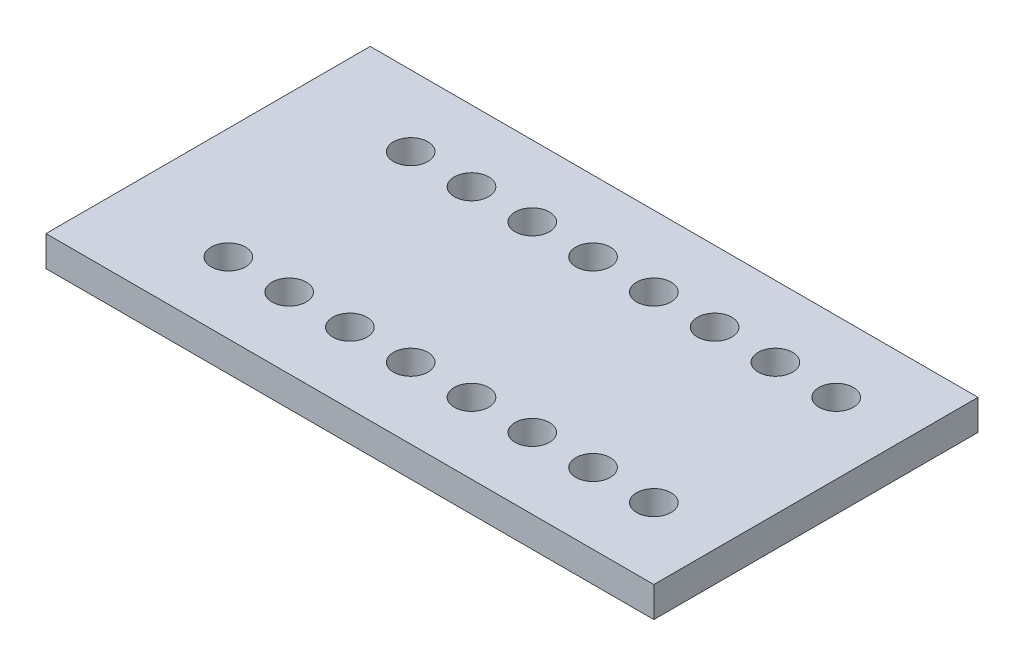
ISO-10303-21;
HEADER;
FILE_DESCRIPTION(('STEP AP214'),'2;1');
FILE_NAME('part.step','',(''),(''),'','','');
FILE_SCHEMA(('AUTOMOTIVE_DESIGN { 1 0 10303 214 1 1 1 1 }'));
ENDSEC;
DATA;
#1=APPLICATION_CONTEXT('core data for automotive mechanical design processes');
#2=APPLICATION_PROTOCOL_DEFINITION('international standard','automotive_design',2000,#1);
#3=PRODUCT_CONTEXT('',#1,'mechanical');
#4=PRODUCT('Part','Part','',(#3));
#5=PRODUCT_RELATED_PRODUCT_CATEGORY('part','',(#4));
#6=PRODUCT_DEFINITION_FORMATION('','',#4);
#7=PRODUCT_DEFINITION_CONTEXT('part definition',#1,'design');
#8=PRODUCT_DEFINITION('design','',#6,#7);
#9=PRODUCT_DEFINITION_SHAPE('','',#8);
#10=(LENGTH_UNIT() NAMED_UNIT(*) SI_UNIT(.MILLI.,.METRE.));
#11=(NAMED_UNIT(*) PLANE_ANGLE_UNIT() SI_UNIT($,.RADIAN.));
#12=(NAMED_UNIT(*) SI_UNIT($,.STERADIAN.) SOLID_ANGLE_UNIT());
#13=UNCERTAINTY_MEASURE_WITH_UNIT(LENGTH_MEASURE(1.E-05),#10,'distance_accuracy_value','');
#14=(GEOMETRIC_REPRESENTATION_CONTEXT(3) GLOBAL_UNCERTAINTY_ASSIGNED_CONTEXT((#13)) GLOBAL_UNIT_ASSIGNED_CONTEXT((#10,
#11,#12)) REPRESENTATION_CONTEXT('',''));
#15=CARTESIAN_POINT('',(0.,0.,0.));
#16=DIRECTION('',(0.,0.,1.));
#17=DIRECTION('',(1.,0.,0.));
#18=AXIS2_PLACEMENT_3D('',#15,#16,#17);
#19=CARTESIAN_POINT('',(84.9999999999999,30.0010000000005,-44.9999999999998));
#20=DIRECTION('',(0.,-1.,0.));
#21=DIRECTION('',(0.,0.,-1.));
#22=AXIS2_PLACEMENT_3D('',#19,#20,#21);
#23=CYLINDRICAL_SURFACE('',#22,8.50000000000001);
#24=CARTESIAN_POINT('',(84.9999999999999,-28.0000000000001,-45.0000000000001));
#25=DIRECTION('',(0.,-1.,0.));
#26=DIRECTION('',(0.,0.,-1.));
#27=AXIS2_PLACEMENT_3D('',#24,#25,#26);
#28=CIRCLE('',#27,8.50000000000001);
#29=CARTESIAN_POINT('',(84.9999999999999,-28.0000000000001,-53.5000000000001));
#30=VERTEX_POINT('',#29);
#31=EDGE_CURVE('E41',#30,#30,#28,.T.);
#32=ORIENTED_EDGE('',*,*,#31,.T.);
#33=EDGE_LOOP('',(#32));
#34=FACE_BOUND('',#33,.T.);
#35=CARTESIAN_POINT('',(84.9999999999999,-13.0000000000001,-45.));
#36=DIRECTION('',(0.,-1.,0.));
#37=DIRECTION('',(0.,0.,-1.));
#38=AXIS2_PLACEMENT_3D('',#35,#36,#37);
#39=CIRCLE('',#38,8.50000000000001);
#40=CARTESIAN_POINT('',(84.9999999999999,-13.0000000000001,-53.5));
#41=VERTEX_POINT('',#40);
#42=EDGE_CURVE('E11',#41,#41,#39,.F.);
#43=ORIENTED_EDGE('',*,*,#42,.T.);
#44=EDGE_LOOP('',(#43));
#45=FACE_BOUND('',#44,.T.);
#46=ADVANCED_FACE('F33',(#34,#45),#23,.F.);
#47=CARTESIAN_POINT('',(115.,30.0010000000005,-44.9999999999998));
#48=DIRECTION('',(0.,-1.,0.));
#49=DIRECTION('',(0.,0.,-1.));
#50=AXIS2_PLACEMENT_3D('',#47,#48,#49);
#51=CYLINDRICAL_SURFACE('',#50,8.50000000000001);
#52=CARTESIAN_POINT('',(115.,-28.0000000000001,-45.0000000000001));
#53=DIRECTION('',(0.,-1.,0.));
#54=DIRECTION('',(0.,0.,-1.));
#55=AXIS2_PLACEMENT_3D('',#52,#53,#54);
#56=CIRCLE('',#55,8.50000000000001);
#57=CARTESIAN_POINT('',(115.,-28.0000000000001,-53.5000000000001));
#58=VERTEX_POINT('',#57);
#59=EDGE_CURVE('E171',#58,#58,#56,.T.);
#60=ORIENTED_EDGE('',*,*,#59,.T.);
#61=EDGE_LOOP('',(#60));
#62=FACE_BOUND('',#61,.T.);
#63=CARTESIAN_POINT('',(115.,-13.0000000000001,-45.));
#64=DIRECTION('',(0.,-1.,0.));
#65=DIRECTION('',(0.,0.,-1.));
#66=AXIS2_PLACEMENT_3D('',#63,#64,#65);
#67=CIRCLE('',#66,8.50000000000001);
#68=CARTESIAN_POINT('',(115.,-13.0000000000001,-53.5));
#69=VERTEX_POINT('',#68);
#70=EDGE_CURVE('E174',#69,#69,#67,.F.);
#71=ORIENTED_EDGE('',*,*,#70,.T.);
#72=EDGE_LOOP('',(#71));
#73=FACE_BOUND('',#72,.T.);
#74=ADVANCED_FACE('F196',(#62,#73),#51,.F.);
#75=CARTESIAN_POINT('',(145.,30.0010000000005,-44.9999999999998));
#76=DIRECTION('',(0.,-1.,0.));
#77=DIRECTION('',(0.,0.,-1.));
#78=AXIS2_PLACEMENT_3D('',#75,#76,#77);
#79=CYLINDRICAL_SURFACE('',#78,8.50000000000001);
#80=CARTESIAN_POINT('',(145.,-28.0000000000001,-45.0000000000001));
#81=DIRECTION('',(0.,-1.,0.));
#82=DIRECTION('',(0.,0.,-1.));
#83=AXIS2_PLACEMENT_3D('',#80,#81,#82);
#84=CIRCLE('',#83,8.50000000000001);
#85=CARTESIAN_POINT('',(145.,-28.0000000000001,-53.5000000000001));
#86=VERTEX_POINT('',#85);
#87=EDGE_CURVE('E165',#86,#86,#84,.T.);
#88=ORIENTED_EDGE('',*,*,#87,.T.);
#89=EDGE_LOOP('',(#88));
#90=FACE_BOUND('',#89,.T.);
#91=CARTESIAN_POINT('',(145.,-13.0000000000001,-45.));
#92=DIRECTION('',(0.,-1.,0.));
#93=DIRECTION('',(0.,0.,-1.));
#94=AXIS2_PLACEMENT_3D('',#91,#92,#93);
#95=CIRCLE('',#94,8.50000000000001);
#96=CARTESIAN_POINT('',(145.,-13.0000000000001,-53.5));
#97=VERTEX_POINT('',#96);
#98=EDGE_CURVE('E168',#97,#97,#95,.F.);
#99=ORIENTED_EDGE('',*,*,#98,.T.);
#100=EDGE_LOOP('',(#99));
#101=FACE_BOUND('',#100,.T.);
#102=ADVANCED_FACE('F200',(#90,#101),#79,.F.);
#103=CARTESIAN_POINT('',(175.,30.0010000000005,-44.9999999999998));
#104=DIRECTION('',(0.,-1.,0.));
#105=DIRECTION('',(0.,0.,-1.));
#106=AXIS2_PLACEMENT_3D('',#103,#104,#105);
#107=CYLINDRICAL_SURFACE('',#106,8.50000000000001);
#108=CARTESIAN_POINT('',(175.,-28.0000000000001,-45.0000000000001));
#109=DIRECTION('',(0.,-1.,0.));
#110=DIRECTION('',(0.,0.,-1.));
#111=AXIS2_PLACEMENT_3D('',#108,#109,#110);
#112=CIRCLE('',#111,8.50000000000001);
#113=CARTESIAN_POINT('',(175.,-28.0000000000001,-53.5000000000001));
#114=VERTEX_POINT('',#113);
#115=EDGE_CURVE('E159',#114,#114,#112,.T.);
#116=ORIENTED_EDGE('',*,*,#115,.T.);
#117=EDGE_LOOP('',(#116));
#118=FACE_BOUND('',#117,.T.);
#119=CARTESIAN_POINT('',(175.,-13.0000000000001,-45.));
#120=DIRECTION('',(0.,-1.,0.));
#121=DIRECTION('',(0.,0.,-1.));
#122=AXIS2_PLACEMENT_3D('',#119,#120,#121);
#123=CIRCLE('',#122,8.50000000000001);
#124=CARTESIAN_POINT('',(175.,-13.0000000000001,-53.5));
#125=VERTEX_POINT('',#124);
#126=EDGE_CURVE('E162',#125,#125,#123,.F.);
#127=ORIENTED_EDGE('',*,*,#126,.T.);
#128=EDGE_LOOP('',(#127));
#129=FACE_BOUND('',#128,.T.);
#130=ADVANCED_FACE('F205',(#118,#129),#107,.F.);
#131=CARTESIAN_POINT('',(205.,30.0010000000005,-44.9999999999998));
#132=DIRECTION('',(0.,-1.,0.));
#133=DIRECTION('',(0.,0.,-1.));
#134=AXIS2_PLACEMENT_3D('',#131,#132,#133);
#135=CYLINDRICAL_SURFACE('',#134,8.50000000000001);
#136=CARTESIAN_POINT('',(205.,-28.0000000000001,-45.0000000000001));
#137=DIRECTION('',(0.,-1.,0.));
#138=DIRECTION('',(0.,0.,-1.));
#139=AXIS2_PLACEMENT_3D('',#136,#137,#138);
#140=CIRCLE('',#139,8.50000000000001);
#141=CARTESIAN_POINT('',(205.,-28.0000000000001,-53.5000000000001));
#142=VERTEX_POINT('',#141);
#143=EDGE_CURVE('E153',#142,#142,#140,.T.);
#144=ORIENTED_EDGE('',*,*,#143,.T.);
#145=EDGE_LOOP('',(#144));
#146=FACE_BOUND('',#145,.T.);
#147=CARTESIAN_POINT('',(205.,-13.0000000000001,-45.));
#148=DIRECTION('',(0.,-1.,0.));
#149=DIRECTION('',(0.,0.,-1.));
#150=AXIS2_PLACEMENT_3D('',#147,#148,#149);
#151=CIRCLE('',#150,8.50000000000001);
#152=CARTESIAN_POINT('',(205.,-13.0000000000001,-53.5));
#153=VERTEX_POINT('',#152);
#154=EDGE_CURVE('E156',#153,#153,#151,.F.);
#155=ORIENTED_EDGE('',*,*,#154,.T.);
#156=EDGE_LOOP('',(#155));
#157=FACE_BOUND('',#156,.T.);
#158=ADVANCED_FACE('F212',(#146,#157),#135,.F.);
#159=CARTESIAN_POINT('',(235.,30.0010000000005,-44.9999999999998));
#160=DIRECTION('',(0.,-1.,0.));
#161=DIRECTION('',(0.,0.,-1.));
#162=AXIS2_PLACEMENT_3D('',#159,#160,#161);
#163=CYLINDRICAL_SURFACE('',#162,8.50000000000001);
#164=CARTESIAN_POINT('',(235.,-28.0000000000001,-45.0000000000001));
#165=DIRECTION('',(0.,-1.,0.));
#166=DIRECTION('',(0.,0.,-1.));
#167=AXIS2_PLACEMENT_3D('',#164,#165,#166);
#168=CIRCLE('',#167,8.50000000000001);
#169=CARTESIAN_POINT('',(235.,-28.0000000000001,-53.5000000000001));
#170=VERTEX_POINT('',#169);
#171=EDGE_CURVE('E147',#170,#170,#168,.T.);
#172=ORIENTED_EDGE('',*,*,#171,.T.);
#173=EDGE_LOOP('',(#172));
#174=FACE_BOUND('',#173,.T.);
#175=CARTESIAN_POINT('',(235.,-13.0000000000001,-45.));
#176=DIRECTION('',(0.,-1.,0.));
#177=DIRECTION('',(0.,0.,-1.));
#178=AXIS2_PLACEMENT_3D('',#175,#176,#177);
#179=CIRCLE('',#178,8.50000000000001);
#180=CARTESIAN_POINT('',(235.,-13.0000000000001,-53.5));
#181=VERTEX_POINT('',#180);
#182=EDGE_CURVE('E150',#181,#181,#179,.F.);
#183=ORIENTED_EDGE('',*,*,#182,.T.);
#184=EDGE_LOOP('',(#183));
#185=FACE_BOUND('',#184,.T.);
#186=ADVANCED_FACE('F216',(#174,#185),#163,.F.);
#187=CARTESIAN_POINT('',(84.9999999999999,30.0010000000002,45.0000000000002));
#188=DIRECTION('',(0.,-1.,0.));
#189=DIRECTION('',(0.,0.,-1.));
#190=AXIS2_PLACEMENT_3D('',#187,#188,#189);
#191=CYLINDRICAL_SURFACE('',#190,8.50000000000001);
#192=CARTESIAN_POINT('',(84.9999999999999,-28.0000000000004,45.));
#193=DIRECTION('',(0.,-1.,0.));
#194=DIRECTION('',(0.,0.,-1.));
#195=AXIS2_PLACEMENT_3D('',#192,#193,#194);
#196=CIRCLE('',#195,8.50000000000001);
#197=CARTESIAN_POINT('',(84.9999999999999,-28.0000000000004,36.5));
#198=VERTEX_POINT('',#197);
#199=EDGE_CURVE('E141',#198,#198,#196,.T.);
#200=ORIENTED_EDGE('',*,*,#199,.T.);
#201=EDGE_LOOP('',(#200));
#202=FACE_BOUND('',#201,.T.);
#203=CARTESIAN_POINT('',(84.9999999999999,-13.0000000000004,45.));
#204=DIRECTION('',(0.,-1.,0.));
#205=DIRECTION('',(0.,0.,-1.));
#206=AXIS2_PLACEMENT_3D('',#203,#204,#205);
#207=CIRCLE('',#206,8.50000000000001);
#208=CARTESIAN_POINT('',(84.9999999999999,-13.0000000000004,36.5));
#209=VERTEX_POINT('',#208);
#210=EDGE_CURVE('E144',#209,#209,#207,.F.);
#211=ORIENTED_EDGE('',*,*,#210,.T.);
#212=EDGE_LOOP('',(#211));
#213=FACE_BOUND('',#212,.T.);
#214=ADVANCED_FACE('F220',(#202,#213),#191,.F.);
#215=CARTESIAN_POINT('',(115.,30.0010000000002,45.0000000000002));
#216=DIRECTION('',(0.,-1.,0.));
#217=DIRECTION('',(0.,0.,-1.));
#218=AXIS2_PLACEMENT_3D('',#215,#216,#217);
#219=CYLINDRICAL_SURFACE('',#218,8.50000000000001);
#220=CARTESIAN_POINT('',(115.,-28.0000000000004,45.));
#221=DIRECTION('',(0.,-1.,0.));
#222=DIRECTION('',(0.,0.,-1.));
#223=AXIS2_PLACEMENT_3D('',#220,#221,#222);
#224=CIRCLE('',#223,8.50000000000001);
#225=CARTESIAN_POINT('',(115.,-28.0000000000004,36.5));
#226=VERTEX_POINT('',#225);
#227=EDGE_CURVE('E135',#226,#226,#224,.T.);
#228=ORIENTED_EDGE('',*,*,#227,.T.);
#229=EDGE_LOOP('',(#228));
#230=FACE_BOUND('',#229,.T.);
#231=CARTESIAN_POINT('',(115.,-13.0000000000004,45.));
#232=DIRECTION('',(0.,-1.,0.));
#233=DIRECTION('',(0.,0.,-1.));
#234=AXIS2_PLACEMENT_3D('',#231,#232,#233);
#235=CIRCLE('',#234,8.50000000000001);
#236=CARTESIAN_POINT('',(115.,-13.0000000000004,36.5));
#237=VERTEX_POINT('',#236);
#238=EDGE_CURVE('E138',#237,#237,#235,.F.);
#239=ORIENTED_EDGE('',*,*,#238,.T.);
#240=EDGE_LOOP('',(#239));
#241=FACE_BOUND('',#240,.T.);
#242=ADVANCED_FACE('F224',(#230,#241),#219,.F.);
#243=CARTESIAN_POINT('',(145.,30.0010000000002,45.0000000000002));
#244=DIRECTION('',(0.,-1.,0.));
#245=DIRECTION('',(0.,0.,-1.));
#246=AXIS2_PLACEMENT_3D('',#243,#244,#245);
#247=CYLINDRICAL_SURFACE('',#246,8.50000000000001);
#248=CARTESIAN_POINT('',(145.,-28.0000000000004,45.));
#249=DIRECTION('',(0.,-1.,0.));
#250=DIRECTION('',(0.,0.,-1.));
#251=AXIS2_PLACEMENT_3D('',#248,#249,#250);
#252=CIRCLE('',#251,8.50000000000001);
#253=CARTESIAN_POINT('',(145.,-28.0000000000004,36.5));
#254=VERTEX_POINT('',#253);
#255=EDGE_CURVE('E129',#254,#254,#252,.T.);
#256=ORIENTED_EDGE('',*,*,#255,.T.);
#257=EDGE_LOOP('',(#256));
#258=FACE_BOUND('',#257,.T.);
#259=CARTESIAN_POINT('',(145.,-13.0000000000004,45.));
#260=DIRECTION('',(0.,-1.,0.));
#261=DIRECTION('',(0.,0.,-1.));
#262=AXIS2_PLACEMENT_3D('',#259,#260,#261);
#263=CIRCLE('',#262,8.50000000000001);
#264=CARTESIAN_POINT('',(145.,-13.0000000000004,36.5));
#265=VERTEX_POINT('',#264);
#266=EDGE_CURVE('E132',#265,#265,#263,.F.);
#267=ORIENTED_EDGE('',*,*,#266,.T.);
#268=EDGE_LOOP('',(#267));
#269=FACE_BOUND('',#268,.T.);
#270=ADVANCED_FACE('F228',(#258,#269),#247,.F.);
#271=CARTESIAN_POINT('',(175.,30.0010000000002,45.0000000000002));
#272=DIRECTION('',(0.,-1.,0.));
#273=DIRECTION('',(0.,0.,-1.));
#274=AXIS2_PLACEMENT_3D('',#271,#272,#273);
#275=CYLINDRICAL_SURFACE('',#274,8.50000000000001);
#276=CARTESIAN_POINT('',(175.,-28.0000000000004,45.));
#277=DIRECTION('',(0.,-1.,0.));
#278=DIRECTION('',(0.,0.,-1.));
#279=AXIS2_PLACEMENT_3D('',#276,#277,#278);
#280=CIRCLE('',#279,8.50000000000001);
#281=CARTESIAN_POINT('',(175.,-28.0000000000004,36.5));
#282=VERTEX_POINT('',#281);
#283=EDGE_CURVE('E123',#282,#282,#280,.T.);
#284=ORIENTED_EDGE('',*,*,#283,.T.);
#285=EDGE_LOOP('',(#284));
#286=FACE_BOUND('',#285,.T.);
#287=CARTESIAN_POINT('',(175.,-13.0000000000004,45.));
#288=DIRECTION('',(0.,-1.,0.));
#289=DIRECTION('',(0.,0.,-1.));
#290=AXIS2_PLACEMENT_3D('',#287,#288,#289);
#291=CIRCLE('',#290,8.50000000000001);
#292=CARTESIAN_POINT('',(175.,-13.0000000000004,36.5));
#293=VERTEX_POINT('',#292);
#294=EDGE_CURVE('E126',#293,#293,#291,.F.);
#295=ORIENTED_EDGE('',*,*,#294,.T.);
#296=EDGE_LOOP('',(#295));
#297=FACE_BOUND('',#296,.T.);
#298=ADVANCED_FACE('F232',(#286,#297),#275,.F.);
#299=CARTESIAN_POINT('',(205.,30.0010000000002,45.0000000000002));
#300=DIRECTION('',(0.,-1.,0.));
#301=DIRECTION('',(0.,0.,-1.));
#302=AXIS2_PLACEMENT_3D('',#299,#300,#301);
#303=CYLINDRICAL_SURFACE('',#302,8.50000000000001);
#304=CARTESIAN_POINT('',(205.,-28.0000000000004,45.));
#305=DIRECTION('',(0.,-1.,0.));
#306=DIRECTION('',(0.,0.,-1.));
#307=AXIS2_PLACEMENT_3D('',#304,#305,#306);
#308=CIRCLE('',#307,8.50000000000001);
#309=CARTESIAN_POINT('',(205.,-28.0000000000004,36.5));
#310=VERTEX_POINT('',#309);
#311=EDGE_CURVE('E117',#310,#310,#308,.T.);
#312=ORIENTED_EDGE('',*,*,#311,.T.);
#313=EDGE_LOOP('',(#312));
#314=FACE_BOUND('',#313,.T.);
#315=CARTESIAN_POINT('',(205.,-13.0000000000004,45.));
#316=DIRECTION('',(0.,-1.,0.));
#317=DIRECTION('',(0.,0.,-1.));
#318=AXIS2_PLACEMENT_3D('',#315,#316,#317);
#319=CIRCLE('',#318,8.50000000000001);
#320=CARTESIAN_POINT('',(205.,-13.0000000000004,36.5));
#321=VERTEX_POINT('',#320);
#322=EDGE_CURVE('E120',#321,#321,#319,.F.);
#323=ORIENTED_EDGE('',*,*,#322,.T.);
#324=EDGE_LOOP('',(#323));
#325=FACE_BOUND('',#324,.T.);
#326=ADVANCED_FACE('F236',(#314,#325),#303,.F.);
#327=CARTESIAN_POINT('',(235.,30.0010000000002,45.0000000000002));
#328=DIRECTION('',(0.,-1.,0.));
#329=DIRECTION('',(0.,0.,-1.));
#330=AXIS2_PLACEMENT_3D('',#327,#328,#329);
#331=CYLINDRICAL_SURFACE('',#330,8.50000000000001);
#332=CARTESIAN_POINT('',(235.,-28.0000000000004,45.));
#333=DIRECTION('',(0.,-1.,0.));
#334=DIRECTION('',(0.,0.,-1.));
#335=AXIS2_PLACEMENT_3D('',#332,#333,#334);
#336=CIRCLE('',#335,8.50000000000001);
#337=CARTESIAN_POINT('',(235.,-28.0000000000004,36.5));
#338=VERTEX_POINT('',#337);
#339=EDGE_CURVE('E111',#338,#338,#336,.T.);
#340=ORIENTED_EDGE('',*,*,#339,.T.);
#341=EDGE_LOOP('',(#340));
#342=FACE_BOUND('',#341,.T.);
#343=CARTESIAN_POINT('',(235.,-13.0000000000004,45.));
#344=DIRECTION('',(0.,-1.,0.));
#345=DIRECTION('',(0.,0.,-1.));
#346=AXIS2_PLACEMENT_3D('',#343,#344,#345);
#347=CIRCLE('',#346,8.50000000000001);
#348=CARTESIAN_POINT('',(235.,-13.0000000000004,36.5));
#349=VERTEX_POINT('',#348);
#350=EDGE_CURVE('E114',#349,#349,#347,.F.);
#351=ORIENTED_EDGE('',*,*,#350,.T.);
#352=EDGE_LOOP('',(#351));
#353=FACE_BOUND('',#352,.T.);
#354=ADVANCED_FACE('F240',(#342,#353),#331,.F.);
#355=CARTESIAN_POINT('',(330.,-13.,-80.));
#356=DIRECTION('',(0.,0.,1.));
#357=DIRECTION('',(0.,-1.,0.));
#358=AXIS2_PLACEMENT_3D('',#355,#356,#357);
#359=PLANE('',#358);
#360=DIRECTION('',(0.,1.,0.));
#361=VECTOR('',#360,1.);
#362=CARTESIAN_POINT('',(30.,-13.,-80.));
#363=LINE('',#362,#361);
#364=CARTESIAN_POINT('',(30.,-28.,-80.0000000000001));
#365=VERTEX_POINT('',#364);
#366=CARTESIAN_POINT('',(30.,-13.,-80.));
#367=VERTEX_POINT('',#366);
#368=EDGE_CURVE('E101',#365,#367,#363,.T.);
#369=ORIENTED_EDGE('',*,*,#368,.T.);
#370=DIRECTION('',(-1.,0.,0.));
#371=VECTOR('',#370,1.);
#372=CARTESIAN_POINT('',(330.,-13.,-80.));
#373=LINE('',#372,#371);
#374=CARTESIAN_POINT('',(330.,-13.,-80.));
#375=VERTEX_POINT('',#374);
#376=EDGE_CURVE('E92',#375,#367,#373,.T.);
#377=ORIENTED_EDGE('',*,*,#376,.F.);
#378=DIRECTION('',(0.,1.,0.));
#379=VECTOR('',#378,1.);
#380=CARTESIAN_POINT('',(330.,-13.,-80.));
#381=LINE('',#380,#379);
#382=CARTESIAN_POINT('',(330.,-28.,-80.0000000000001));
#383=VERTEX_POINT('',#382);
#384=EDGE_CURVE('E85',#383,#375,#381,.T.);
#385=ORIENTED_EDGE('',*,*,#384,.F.);
#386=DIRECTION('',(-1.,0.,0.));
#387=VECTOR('',#386,1.);
#388=CARTESIAN_POINT('',(330.,-28.,-80.0000000000001));
#389=LINE('',#388,#387);
#390=EDGE_CURVE('E97',#383,#365,#389,.T.);
#391=ORIENTED_EDGE('',*,*,#390,.T.);
#392=EDGE_LOOP('',(#369,#377,#385,#391));
#393=FACE_BOUND('',#392,.T.);
#394=ADVANCED_FACE('F244',(#393),#359,.F.);
#395=CARTESIAN_POINT('',(330.,-13.,-80.));
#396=DIRECTION('',(0.,-1.,0.));
#397=DIRECTION('',(0.,0.,-1.));
#398=AXIS2_PLACEMENT_3D('',#395,#396,#397);
#399=PLANE('',#398);
#400=CARTESIAN_POINT('',(265.,-13.0000000000001,-45.));
#401=DIRECTION('',(0.,-1.,0.));
#402=DIRECTION('',(0.,0.,-1.));
#403=AXIS2_PLACEMENT_3D('',#400,#401,#402);
#404=CIRCLE('',#403,8.50000000000001);
#405=CARTESIAN_POINT('',(265.,-13.0000000000001,-53.5));
#406=VERTEX_POINT('',#405);
#407=EDGE_CURVE('E256',#406,#406,#404,.F.);
#408=ORIENTED_EDGE('',*,*,#407,.F.);
#409=EDGE_LOOP('',(#408));
#410=FACE_BOUND('',#409,.T.);
#411=CARTESIAN_POINT('',(265.,-13.0000000000004,45.));
#412=DIRECTION('',(0.,-1.,0.));
#413=DIRECTION('',(0.,0.,-1.));
#414=AXIS2_PLACEMENT_3D('',#411,#412,#413);
#415=CIRCLE('',#414,8.50000000000001);
#416=CARTESIAN_POINT('',(265.,-13.0000000000004,36.5));
#417=VERTEX_POINT('',#416);
#418=EDGE_CURVE('E260',#417,#417,#415,.F.);
#419=ORIENTED_EDGE('',*,*,#418,.F.);
#420=EDGE_LOOP('',(#419));
#421=FACE_BOUND('',#420,.T.);
#422=CARTESIAN_POINT('',(295.,-13.0000000000004,45.));
#423=DIRECTION('',(0.,-1.,0.));
#424=DIRECTION('',(0.,0.,-1.));
#425=AXIS2_PLACEMENT_3D('',#422,#423,#424);
#426=CIRCLE('',#425,8.50000000000001);
#427=CARTESIAN_POINT('',(295.,-13.0000000000004,36.5));
#428=VERTEX_POINT('',#427);
#429=EDGE_CURVE('E104',#428,#428,#426,.F.);
#430=ORIENTED_EDGE('',*,*,#429,.F.);
#431=EDGE_LOOP('',(#430));
#432=FACE_BOUND('',#431,.T.);
#433=CARTESIAN_POINT('',(295.,-13.0000000000001,-45.));
#434=DIRECTION('',(0.,-1.,0.));
#435=DIRECTION('',(0.,0.,-1.));
#436=AXIS2_PLACEMENT_3D('',#433,#434,#435);
#437=CIRCLE('',#436,8.50000000000001);
#438=CARTESIAN_POINT('',(295.,-13.0000000000001,-53.5));
#439=VERTEX_POINT('',#438);
#440=EDGE_CURVE('E266',#439,#439,#437,.F.);
#441=ORIENTED_EDGE('',*,*,#440,.F.);
#442=EDGE_LOOP('',(#441));
#443=FACE_BOUND('',#442,.T.);
#444=DIRECTION('',(0.,0.,1.));
#445=VECTOR('',#444,1.);
#446=CARTESIAN_POINT('',(30.,-13.,-80.));
#447=LINE('',#446,#445);
#448=CARTESIAN_POINT('',(30.,-13.0000000000006,80.));
#449=VERTEX_POINT('',#448);
#450=EDGE_CURVE('E91',#367,#449,#447,.T.);
#451=ORIENTED_EDGE('',*,*,#450,.T.);
#452=DIRECTION('',(-1.,0.,0.));
#453=VECTOR('',#452,1.);
#454=CARTESIAN_POINT('',(330.,-13.0000000000006,80.));
#455=LINE('',#454,#453);
#456=CARTESIAN_POINT('',(330.,-13.0000000000006,80.));
#457=VERTEX_POINT('',#456);
#458=EDGE_CURVE('E88',#457,#449,#455,.T.);
#459=ORIENTED_EDGE('',*,*,#458,.F.);
#460=DIRECTION('',(0.,0.,1.));
#461=VECTOR('',#460,1.);
#462=CARTESIAN_POINT('',(330.,-13.,-80.));
#463=LINE('',#462,#461);
#464=EDGE_CURVE('E80',#375,#457,#463,.T.);
#465=ORIENTED_EDGE('',*,*,#464,.F.);
#466=ORIENTED_EDGE('',*,*,#376,.T.);
#467=EDGE_LOOP('',(#451,#459,#465,#466));
#468=FACE_BOUND('',#467,.T.);
#469=ORIENTED_EDGE('',*,*,#350,.F.);
#470=EDGE_LOOP('',(#469));
#471=FACE_BOUND('',#470,.T.);
#472=ORIENTED_EDGE('',*,*,#322,.F.);
#473=EDGE_LOOP('',(#472));
#474=FACE_BOUND('',#473,.T.);
#475=ORIENTED_EDGE('',*,*,#294,.F.);
#476=EDGE_LOOP('',(#475));
#477=FACE_BOUND('',#476,.T.);
#478=ORIENTED_EDGE('',*,*,#266,.F.);
#479=EDGE_LOOP('',(#478));
#480=FACE_BOUND('',#479,.T.);
#481=ORIENTED_EDGE('',*,*,#238,.F.);
#482=EDGE_LOOP('',(#481));
#483=FACE_BOUND('',#482,.T.);
#484=ORIENTED_EDGE('',*,*,#210,.F.);
#485=EDGE_LOOP('',(#484));
#486=FACE_BOUND('',#485,.T.);
#487=ORIENTED_EDGE('',*,*,#182,.F.);
#488=EDGE_LOOP('',(#487));
#489=FACE_BOUND('',#488,.T.);
#490=ORIENTED_EDGE('',*,*,#154,.F.);
#491=EDGE_LOOP('',(#490));
#492=FACE_BOUND('',#491,.T.);
#493=ORIENTED_EDGE('',*,*,#126,.F.);
#494=EDGE_LOOP('',(#493));
#495=FACE_BOUND('',#494,.T.);
#496=ORIENTED_EDGE('',*,*,#98,.F.);
#497=EDGE_LOOP('',(#496));
#498=FACE_BOUND('',#497,.T.);
#499=ORIENTED_EDGE('',*,*,#70,.F.);
#500=EDGE_LOOP('',(#499));
#501=FACE_BOUND('',#500,.T.);
#502=ORIENTED_EDGE('',*,*,#42,.F.);
#503=EDGE_LOOP('',(#502));
#504=FACE_BOUND('',#503,.T.);
#505=ADVANCED_FACE('F89',(#410,#421,#432,#443,#468,#471,#474,#477,#480,#483,#486,#489,#492,#495,
#498,#501,#504),#399,.F.);
#506=CARTESIAN_POINT('',(330.,-28.0000000000006,80.));
#507=DIRECTION('',(0.,0.,-1.));
#508=DIRECTION('',(0.,1.,0.));
#509=AXIS2_PLACEMENT_3D('',#506,#507,#508);
#510=PLANE('',#509);
#511=DIRECTION('',(0.,-1.,0.));
#512=VECTOR('',#511,1.);
#513=CARTESIAN_POINT('',(30.,-28.0000000000006,80.));
#514=LINE('',#513,#512);
#515=CARTESIAN_POINT('',(30.,-28.0000000000006,80.));
#516=VERTEX_POINT('',#515);
#517=EDGE_CURVE('E66',#449,#516,#514,.T.);
#518=ORIENTED_EDGE('',*,*,#517,.T.);
#519=DIRECTION('',(-1.,0.,0.));
#520=VECTOR('',#519,1.);
#521=CARTESIAN_POINT('',(330.,-28.0000000000006,80.));
#522=LINE('',#521,#520);
#523=CARTESIAN_POINT('',(330.,-28.0000000000006,80.));
#524=VERTEX_POINT('',#523);
#525=EDGE_CURVE('E93',#524,#516,#522,.T.);
#526=ORIENTED_EDGE('',*,*,#525,.F.);
#527=DIRECTION('',(0.,-1.,0.));
#528=VECTOR('',#527,1.);
#529=CARTESIAN_POINT('',(330.,-28.0000000000006,80.));
#530=LINE('',#529,#528);
#531=EDGE_CURVE('E83',#457,#524,#530,.T.);
#532=ORIENTED_EDGE('',*,*,#531,.F.);
#533=ORIENTED_EDGE('',*,*,#458,.T.);
#534=EDGE_LOOP('',(#518,#526,#532,#533));
#535=FACE_BOUND('',#534,.T.);
#536=ADVANCED_FACE('F95',(#535),#510,.F.);
#537=CARTESIAN_POINT('',(330.,-28.,-80.0000000000001));
#538=DIRECTION('',(0.,1.,0.));
#539=DIRECTION('',(0.,0.,1.));
#540=AXIS2_PLACEMENT_3D('',#537,#538,#539);
#541=PLANE('',#540);
#542=CARTESIAN_POINT('',(265.,-28.0000000000001,-45.0000000000001));
#543=DIRECTION('',(0.,-1.,0.));
#544=DIRECTION('',(0.,0.,-1.));
#545=AXIS2_PLACEMENT_3D('',#542,#543,#544);
#546=CIRCLE('',#545,8.50000000000001);
#547=CARTESIAN_POINT('',(265.,-28.0000000000001,-53.5000000000001));
#548=VERTEX_POINT('',#547);
#549=EDGE_CURVE('E282',#548,#548,#546,.T.);
#550=ORIENTED_EDGE('',*,*,#549,.F.);
#551=EDGE_LOOP('',(#550));
#552=FACE_BOUND('',#551,.T.);
#553=CARTESIAN_POINT('',(265.,-28.0000000000004,45.));
#554=DIRECTION('',(0.,-1.,0.));
#555=DIRECTION('',(0.,0.,-1.));
#556=AXIS2_PLACEMENT_3D('',#553,#554,#555);
#557=CIRCLE('',#556,8.50000000000001);
#558=CARTESIAN_POINT('',(265.,-28.0000000000004,36.5));
#559=VERTEX_POINT('',#558);
#560=EDGE_CURVE('E278',#559,#559,#557,.T.);
#561=ORIENTED_EDGE('',*,*,#560,.F.);
#562=EDGE_LOOP('',(#561));
#563=FACE_BOUND('',#562,.T.);
#564=CARTESIAN_POINT('',(295.,-28.0000000000004,45.));
#565=DIRECTION('',(0.,-1.,0.));
#566=DIRECTION('',(0.,0.,-1.));
#567=AXIS2_PLACEMENT_3D('',#564,#565,#566);
#568=CIRCLE('',#567,8.50000000000001);
#569=CARTESIAN_POINT('',(295.,-28.0000000000004,36.5));
#570=VERTEX_POINT('',#569);
#571=EDGE_CURVE('E268',#570,#570,#568,.T.);
#572=ORIENTED_EDGE('',*,*,#571,.F.);
#573=EDGE_LOOP('',(#572));
#574=FACE_BOUND('',#573,.T.);
#575=CARTESIAN_POINT('',(295.,-28.0000000000001,-45.0000000000001));
#576=DIRECTION('',(0.,-1.,0.));
#577=DIRECTION('',(0.,0.,-1.));
#578=AXIS2_PLACEMENT_3D('',#575,#576,#577);
#579=CIRCLE('',#578,8.50000000000001);
#580=CARTESIAN_POINT('',(295.,-28.0000000000001,-53.5000000000001));
#581=VERTEX_POINT('',#580);
#582=EDGE_CURVE('E269',#581,#581,#579,.T.);
#583=ORIENTED_EDGE('',*,*,#582,.F.);
#584=EDGE_LOOP('',(#583));
#585=FACE_BOUND('',#584,.T.);
#586=DIRECTION('',(0.,0.,-1.));
#587=VECTOR('',#586,1.);
#588=CARTESIAN_POINT('',(30.,-28.,-80.0000000000001));
#589=LINE('',#588,#587);
#590=EDGE_CURVE('E72',#516,#365,#589,.T.);
#591=ORIENTED_EDGE('',*,*,#590,.T.);
#592=ORIENTED_EDGE('',*,*,#390,.F.);
#593=DIRECTION('',(0.,0.,-1.));
#594=VECTOR('',#593,1.);
#595=CARTESIAN_POINT('',(330.,-28.,-80.0000000000001));
#596=LINE('',#595,#594);
#597=EDGE_CURVE('E49',#524,#383,#596,.T.);
#598=ORIENTED_EDGE('',*,*,#597,.F.);
#599=ORIENTED_EDGE('',*,*,#525,.T.);
#600=EDGE_LOOP('',(#591,#592,#598,#599));
#601=FACE_BOUND('',#600,.T.);
#602=ORIENTED_EDGE('',*,*,#339,.F.);
#603=EDGE_LOOP('',(#602));
#604=FACE_BOUND('',#603,.T.);
#605=ORIENTED_EDGE('',*,*,#311,.F.);
#606=EDGE_LOOP('',(#605));
#607=FACE_BOUND('',#606,.T.);
#608=ORIENTED_EDGE('',*,*,#283,.F.);
#609=EDGE_LOOP('',(#608));
#610=FACE_BOUND('',#609,.T.);
#611=ORIENTED_EDGE('',*,*,#255,.F.);
#612=EDGE_LOOP('',(#611));
#613=FACE_BOUND('',#612,.T.);
#614=ORIENTED_EDGE('',*,*,#227,.F.);
#615=EDGE_LOOP('',(#614));
#616=FACE_BOUND('',#615,.T.);
#617=ORIENTED_EDGE('',*,*,#199,.F.);
#618=EDGE_LOOP('',(#617));
#619=FACE_BOUND('',#618,.T.);
#620=ORIENTED_EDGE('',*,*,#171,.F.);
#621=EDGE_LOOP('',(#620));
#622=FACE_BOUND('',#621,.T.);
#623=ORIENTED_EDGE('',*,*,#143,.F.);
#624=EDGE_LOOP('',(#623));
#625=FACE_BOUND('',#624,.T.);
#626=ORIENTED_EDGE('',*,*,#115,.F.);
#627=EDGE_LOOP('',(#626));
#628=FACE_BOUND('',#627,.T.);
#629=ORIENTED_EDGE('',*,*,#87,.F.);
#630=EDGE_LOOP('',(#629));
#631=FACE_BOUND('',#630,.T.);
#632=ORIENTED_EDGE('',*,*,#59,.F.);
#633=EDGE_LOOP('',(#632));
#634=FACE_BOUND('',#633,.T.);
#635=ORIENTED_EDGE('',*,*,#31,.F.);
#636=EDGE_LOOP('',(#635));
#637=FACE_BOUND('',#636,.T.);
#638=ADVANCED_FACE('F181',(#552,#563,#574,#585,#601,#604,#607,#610,#613,#616,#619,#622,#625,
#628,#631,#634,#637),#541,.F.);
#639=CARTESIAN_POINT('',(330.,-7.50000000000028,80.));
#640=DIRECTION('',(-1.,0.,0.));
#641=DIRECTION('',(0.,0.,1.));
#642=AXIS2_PLACEMENT_3D('',#639,#640,#641);
#643=PLANE('',#642);
#644=ORIENTED_EDGE('',*,*,#384,.T.);
#645=ORIENTED_EDGE('',*,*,#464,.T.);
#646=ORIENTED_EDGE('',*,*,#531,.T.);
#647=ORIENTED_EDGE('',*,*,#597,.T.);
#648=EDGE_LOOP('',(#644,#645,#646,#647));
#649=FACE_BOUND('',#648,.T.);
#650=ADVANCED_FACE('F81',(#649),#643,.F.);
#651=CARTESIAN_POINT('',(30.,-7.50000000000028,80.));
#652=DIRECTION('',(-1.,0.,0.));
#653=DIRECTION('',(0.,0.,1.));
#654=AXIS2_PLACEMENT_3D('',#651,#652,#653);
#655=PLANE('',#654);
#656=ORIENTED_EDGE('',*,*,#368,.F.);
#657=ORIENTED_EDGE('',*,*,#590,.F.);
#658=ORIENTED_EDGE('',*,*,#517,.F.);
#659=ORIENTED_EDGE('',*,*,#450,.F.);
#660=EDGE_LOOP('',(#656,#657,#658,#659));
#661=FACE_BOUND('',#660,.T.);
#662=ADVANCED_FACE('F189',(#661),#655,.T.);
#663=CARTESIAN_POINT('',(295.,30.0010000000005,-44.9999999999998));
#664=DIRECTION('',(0.,-1.,0.));
#665=DIRECTION('',(0.,0.,-1.));
#666=AXIS2_PLACEMENT_3D('',#663,#664,#665);
#667=CYLINDRICAL_SURFACE('',#666,8.50000000000001);
#668=ORIENTED_EDGE('',*,*,#582,.T.);
#669=EDGE_LOOP('',(#668));
#670=FACE_BOUND('',#669,.T.);
#671=ORIENTED_EDGE('',*,*,#440,.T.);
#672=EDGE_LOOP('',(#671));
#673=FACE_BOUND('',#672,.T.);
#674=ADVANCED_FACE('F299',(#670,#673),#667,.F.);
#675=CARTESIAN_POINT('',(295.,30.0010000000002,45.0000000000002));
#676=DIRECTION('',(0.,-1.,0.));
#677=DIRECTION('',(0.,0.,-1.));
#678=AXIS2_PLACEMENT_3D('',#675,#676,#677);
#679=CYLINDRICAL_SURFACE('',#678,8.50000000000001);
#680=ORIENTED_EDGE('',*,*,#571,.T.);
#681=EDGE_LOOP('',(#680));
#682=FACE_BOUND('',#681,.T.);
#683=ORIENTED_EDGE('',*,*,#429,.T.);
#684=EDGE_LOOP('',(#683));
#685=FACE_BOUND('',#684,.T.);
#686=ADVANCED_FACE('F293',(#682,#685),#679,.F.);
#687=CARTESIAN_POINT('',(265.,30.0010000000002,45.0000000000002));
#688=DIRECTION('',(0.,-1.,0.));
#689=DIRECTION('',(0.,0.,-1.));
#690=AXIS2_PLACEMENT_3D('',#687,#688,#689);
#691=CYLINDRICAL_SURFACE('',#690,8.50000000000001);
#692=ORIENTED_EDGE('',*,*,#560,.T.);
#693=EDGE_LOOP('',(#692));
#694=FACE_BOUND('',#693,.T.);
#695=ORIENTED_EDGE('',*,*,#418,.T.);
#696=EDGE_LOOP('',(#695));
#697=FACE_BOUND('',#696,.T.);
#698=ADVANCED_FACE('F288',(#694,#697),#691,.F.);
#699=CARTESIAN_POINT('',(265.,30.0010000000005,-44.9999999999998));
#700=DIRECTION('',(0.,-1.,0.));
#701=DIRECTION('',(0.,0.,-1.));
#702=AXIS2_PLACEMENT_3D('',#699,#700,#701);
#703=CYLINDRICAL_SURFACE('',#702,8.50000000000001);
#704=ORIENTED_EDGE('',*,*,#549,.T.);
#705=EDGE_LOOP('',(#704));
#706=FACE_BOUND('',#705,.T.);
#707=ORIENTED_EDGE('',*,*,#407,.T.);
#708=EDGE_LOOP('',(#707));
#709=FACE_BOUND('',#708,.T.);
#710=ADVANCED_FACE('F285',(#706,#709),#703,.F.);
#711=CLOSED_SHELL('',(#46,#74,#102,#130,#158,#186,#214,#242,#270,#298,#326,#354,#394,#505,#536,
#638,#650,#662,#674,#686,#698,#710));
#712=MANIFOLD_SOLID_BREP('B2',#711);
#713=ADVANCED_BREP_SHAPE_REPRESENTATION('',(#18,#712),#14);
#714=SHAPE_DEFINITION_REPRESENTATION(#9,#713);
ENDSEC;
END-ISO-10303-21;
